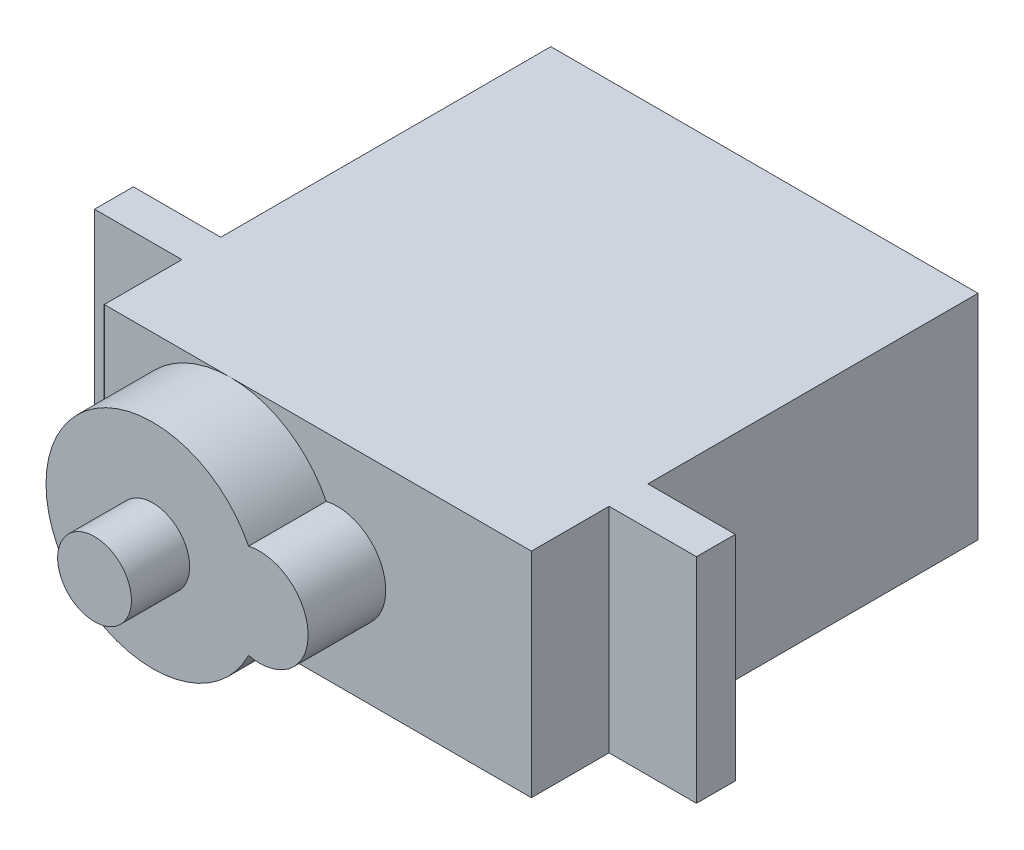
ISO-10303-21;
HEADER;
FILE_DESCRIPTION(('STEP AP214'),'2;1');
FILE_NAME('part.step','',(''),(''),'','','');
FILE_SCHEMA(('AUTOMOTIVE_DESIGN { 1 0 10303 214 1 1 1 1 }'));
ENDSEC;
DATA;
#1=APPLICATION_CONTEXT('core data for automotive mechanical design processes');
#2=APPLICATION_PROTOCOL_DEFINITION('international standard','automotive_design',2000,#1);
#3=PRODUCT_CONTEXT('',#1,'mechanical');
#4=PRODUCT('Part','Part','',(#3));
#5=PRODUCT_RELATED_PRODUCT_CATEGORY('part','',(#4));
#6=PRODUCT_DEFINITION_FORMATION('','',#4);
#7=PRODUCT_DEFINITION_CONTEXT('part definition',#1,'design');
#8=PRODUCT_DEFINITION('design','',#6,#7);
#9=PRODUCT_DEFINITION_SHAPE('','',#8);
#10=(LENGTH_UNIT() NAMED_UNIT(*) SI_UNIT(.MILLI.,.METRE.));
#11=(NAMED_UNIT(*) PLANE_ANGLE_UNIT() SI_UNIT($,.RADIAN.));
#12=(NAMED_UNIT(*) SI_UNIT($,.STERADIAN.) SOLID_ANGLE_UNIT());
#13=UNCERTAINTY_MEASURE_WITH_UNIT(LENGTH_MEASURE(1.E-05),#10,'distance_accuracy_value','');
#14=(GEOMETRIC_REPRESENTATION_CONTEXT(3) GLOBAL_UNCERTAINTY_ASSIGNED_CONTEXT((#13)) GLOBAL_UNIT_ASSIGNED_CONTEXT((#10,
#11,#12)) REPRESENTATION_CONTEXT('',''));
#15=CARTESIAN_POINT('',(0.,0.,0.));
#16=DIRECTION('',(0.,0.,1.));
#17=DIRECTION('',(1.,0.,0.));
#18=AXIS2_PLACEMENT_3D('',#15,#16,#17);
#19=CARTESIAN_POINT('',(0.,0.,23.));
#20=DIRECTION('',(0.,0.,1.));
#21=DIRECTION('',(1.,0.,0.));
#22=AXIS2_PLACEMENT_3D('',#19,#20,#21);
#23=PLANE('',#22);
#24=DIRECTION('',(1.,0.,0.));
#25=VECTOR('',#24,1.);
#26=CARTESIAN_POINT('',(-15.5,-5.50000000000001,23.));
#27=LINE('',#26,#25);
#28=CARTESIAN_POINT('',(-11.,-5.50000000000001,23.));
#29=VERTEX_POINT('',#28);
#30=CARTESIAN_POINT('',(-4.5,-5.5,23.));
#31=VERTEX_POINT('',#30);
#32=EDGE_CURVE('E243',#29,#31,#27,.T.);
#33=ORIENTED_EDGE('',*,*,#32,.T.);
#34=CARTESIAN_POINT('',(-4.5,0.,23.));
#35=DIRECTION('',(0.,0.,1.));
#36=DIRECTION('',(1.,0.,0.));
#37=AXIS2_PLACEMENT_3D('',#34,#35,#36);
#38=CIRCLE('',#37,5.5);
#39=CARTESIAN_POINT('',(-4.5,5.5,23.));
#40=VERTEX_POINT('',#39);
#41=EDGE_CURVE('E503',#40,#31,#38,.T.);
#42=ORIENTED_EDGE('',*,*,#41,.F.);
#43=DIRECTION('',(-1.,0.,0.));
#44=VECTOR('',#43,1.);
#45=CARTESIAN_POINT('',(-15.5,5.50000000000001,23.));
#46=LINE('',#45,#44);
#47=CARTESIAN_POINT('',(-11.,5.5,23.));
#48=VERTEX_POINT('',#47);
#49=EDGE_CURVE('E242',#40,#48,#46,.T.);
#50=ORIENTED_EDGE('',*,*,#49,.T.);
#51=DIRECTION('',(0.,-1.,0.));
#52=VECTOR('',#51,1.);
#53=CARTESIAN_POINT('',(-11.,0.,23.));
#54=LINE('',#53,#52);
#55=EDGE_CURVE('E204',#48,#29,#54,.T.);
#56=ORIENTED_EDGE('',*,*,#55,.T.);
#57=EDGE_LOOP('',(#33,#42,#50,#56));
#58=FACE_BOUND('',#57,.T.);
#59=ADVANCED_FACE('F35',(#58),#23,.T.);
#60=CARTESIAN_POINT('',(-15.5,5.50000000000001,23.));
#61=DIRECTION('',(0.,-1.,0.));
#62=DIRECTION('',(1.,0.,0.));
#63=AXIS2_PLACEMENT_3D('',#60,#61,#62);
#64=PLANE('',#63);
#65=DIRECTION('',(0.,0.,1.));
#66=VECTOR('',#65,1.);
#67=CARTESIAN_POINT('',(-11.,5.5,0.));
#68=LINE('',#67,#66);
#69=CARTESIAN_POINT('',(-11.,5.5,0.));
#70=VERTEX_POINT('',#69);
#71=CARTESIAN_POINT('',(-11.,5.5,17.));
#72=VERTEX_POINT('',#71);
#73=EDGE_CURVE('E59',#70,#72,#68,.T.);
#74=ORIENTED_EDGE('',*,*,#73,.T.);
#75=DIRECTION('',(-1.,0.,0.));
#76=VECTOR('',#75,1.);
#77=CARTESIAN_POINT('',(0.,5.5,17.));
#78=LINE('',#77,#76);
#79=CARTESIAN_POINT('',(-15.5,5.50000000000001,17.));
#80=VERTEX_POINT('',#79);
#81=EDGE_CURVE('E170',#72,#80,#78,.T.);
#82=ORIENTED_EDGE('',*,*,#81,.T.);
#83=DIRECTION('',(0.,0.,-1.));
#84=VECTOR('',#83,1.);
#85=CARTESIAN_POINT('',(-15.5,5.50000000000001,23.));
#86=LINE('',#85,#84);
#87=CARTESIAN_POINT('',(-15.5,5.50000000000001,19.));
#88=VERTEX_POINT('',#87);
#89=EDGE_CURVE('E44',#88,#80,#86,.T.);
#90=ORIENTED_EDGE('',*,*,#89,.F.);
#91=DIRECTION('',(-1.,0.,0.));
#92=VECTOR('',#91,1.);
#93=CARTESIAN_POINT('',(0.,5.5,19.));
#94=LINE('',#93,#92);
#95=CARTESIAN_POINT('',(-11.,5.5,19.));
#96=VERTEX_POINT('',#95);
#97=EDGE_CURVE('E203',#96,#88,#94,.T.);
#98=ORIENTED_EDGE('',*,*,#97,.F.);
#99=DIRECTION('',(0.,0.,1.));
#100=VECTOR('',#99,1.);
#101=CARTESIAN_POINT('',(-11.,5.5,19.));
#102=LINE('',#101,#100);
#103=EDGE_CURVE('E211',#96,#48,#102,.T.);
#104=ORIENTED_EDGE('',*,*,#103,.T.);
#105=ORIENTED_EDGE('',*,*,#49,.F.);
#106=CARTESIAN_POINT('',(11.,5.5,23.));
#107=VERTEX_POINT('',#106);
#108=EDGE_CURVE('E238',#107,#40,#46,.T.);
#109=ORIENTED_EDGE('',*,*,#108,.F.);
#110=DIRECTION('',(0.,0.,1.));
#111=VECTOR('',#110,1.);
#112=CARTESIAN_POINT('',(11.,5.5,19.));
#113=LINE('',#112,#111);
#114=CARTESIAN_POINT('',(11.,5.5,19.));
#115=VERTEX_POINT('',#114);
#116=EDGE_CURVE('E229',#115,#107,#113,.T.);
#117=ORIENTED_EDGE('',*,*,#116,.F.);
#118=DIRECTION('',(-1.,0.,0.));
#119=VECTOR('',#118,1.);
#120=CARTESIAN_POINT('',(0.,5.5,19.));
#121=LINE('',#120,#119);
#122=CARTESIAN_POINT('',(15.5,5.5,19.));
#123=VERTEX_POINT('',#122);
#124=EDGE_CURVE('E220',#123,#115,#121,.T.);
#125=ORIENTED_EDGE('',*,*,#124,.F.);
#126=DIRECTION('',(0.,0.,-1.));
#127=VECTOR('',#126,1.);
#128=CARTESIAN_POINT('',(15.5,5.5,23.));
#129=LINE('',#128,#127);
#130=CARTESIAN_POINT('',(15.5,5.5,17.));
#131=VERTEX_POINT('',#130);
#132=EDGE_CURVE('E11',#123,#131,#129,.T.);
#133=ORIENTED_EDGE('',*,*,#132,.T.);
#134=DIRECTION('',(-1.,0.,0.));
#135=VECTOR('',#134,1.);
#136=CARTESIAN_POINT('',(0.,5.5,17.));
#137=LINE('',#136,#135);
#138=CARTESIAN_POINT('',(11.,5.5,17.));
#139=VERTEX_POINT('',#138);
#140=EDGE_CURVE('E160',#131,#139,#137,.T.);
#141=ORIENTED_EDGE('',*,*,#140,.T.);
#142=DIRECTION('',(0.,0.,1.));
#143=VECTOR('',#142,1.);
#144=CARTESIAN_POINT('',(11.,5.5,0.));
#145=LINE('',#144,#143);
#146=CARTESIAN_POINT('',(11.,5.5,0.));
#147=VERTEX_POINT('',#146);
#148=EDGE_CURVE('E186',#147,#139,#145,.T.);
#149=ORIENTED_EDGE('',*,*,#148,.F.);
#150=DIRECTION('',(-1.,0.,0.));
#151=VECTOR('',#150,1.);
#152=CARTESIAN_POINT('',(-15.5,5.50000000000001,0.));
#153=LINE('',#152,#151);
#154=EDGE_CURVE('E237',#147,#70,#153,.T.);
#155=ORIENTED_EDGE('',*,*,#154,.T.);
#156=EDGE_LOOP('',(#74,#82,#90,#98,#104,#105,#109,#117,#125,#133,#141,#149,#155));
#157=FACE_BOUND('',#156,.T.);
#158=ADVANCED_FACE('F265',(#157),#64,.F.);
#159=CARTESIAN_POINT('',(-15.5,-5.50000000000001,23.));
#160=DIRECTION('',(0.,1.,0.));
#161=DIRECTION('',(0.,0.,1.));
#162=AXIS2_PLACEMENT_3D('',#159,#160,#161);
#163=PLANE('',#162);
#164=DIRECTION('',(0.,0.,1.));
#165=VECTOR('',#164,1.);
#166=CARTESIAN_POINT('',(-11.,-5.50000000000001,0.));
#167=LINE('',#166,#165);
#168=CARTESIAN_POINT('',(-11.,-5.50000000000001,0.));
#169=VERTEX_POINT('',#168);
#170=CARTESIAN_POINT('',(-11.,-5.50000000000001,17.));
#171=VERTEX_POINT('',#170);
#172=EDGE_CURVE('E179',#169,#171,#167,.T.);
#173=ORIENTED_EDGE('',*,*,#172,.F.);
#174=DIRECTION('',(1.,0.,0.));
#175=VECTOR('',#174,1.);
#176=CARTESIAN_POINT('',(-15.5,-5.50000000000001,0.));
#177=LINE('',#176,#175);
#178=CARTESIAN_POINT('',(11.,-5.50000000000001,0.));
#179=VERTEX_POINT('',#178);
#180=EDGE_CURVE('E249',#169,#179,#177,.T.);
#181=ORIENTED_EDGE('',*,*,#180,.T.);
#182=DIRECTION('',(0.,0.,1.));
#183=VECTOR('',#182,1.);
#184=CARTESIAN_POINT('',(11.,-5.50000000000001,0.));
#185=LINE('',#184,#183);
#186=CARTESIAN_POINT('',(11.,-5.50000000000001,17.));
#187=VERTEX_POINT('',#186);
#188=EDGE_CURVE('E171',#179,#187,#185,.T.);
#189=ORIENTED_EDGE('',*,*,#188,.T.);
#190=DIRECTION('',(1.,0.,0.));
#191=VECTOR('',#190,1.);
#192=CARTESIAN_POINT('',(0.,-5.50000000000001,17.));
#193=LINE('',#192,#191);
#194=CARTESIAN_POINT('',(15.5,-5.50000000000001,17.));
#195=VERTEX_POINT('',#194);
#196=EDGE_CURVE('E193',#187,#195,#193,.T.);
#197=ORIENTED_EDGE('',*,*,#196,.T.);
#198=DIRECTION('',(0.,0.,-1.));
#199=VECTOR('',#198,1.);
#200=CARTESIAN_POINT('',(15.5,-5.50000000000001,23.));
#201=LINE('',#200,#199);
#202=CARTESIAN_POINT('',(15.5,-5.50000000000001,19.));
#203=VERTEX_POINT('',#202);
#204=EDGE_CURVE('E246',#203,#195,#201,.T.);
#205=ORIENTED_EDGE('',*,*,#204,.F.);
#206=DIRECTION('',(1.,0.,0.));
#207=VECTOR('',#206,1.);
#208=CARTESIAN_POINT('',(0.,-5.50000000000001,19.));
#209=LINE('',#208,#207);
#210=CARTESIAN_POINT('',(11.,-5.50000000000001,19.));
#211=VERTEX_POINT('',#210);
#212=EDGE_CURVE('E225',#211,#203,#209,.T.);
#213=ORIENTED_EDGE('',*,*,#212,.F.);
#214=DIRECTION('',(0.,0.,1.));
#215=VECTOR('',#214,1.);
#216=CARTESIAN_POINT('',(11.,-5.50000000000001,19.));
#217=LINE('',#216,#215);
#218=CARTESIAN_POINT('',(11.,-5.50000000000001,23.));
#219=VERTEX_POINT('',#218);
#220=EDGE_CURVE('E214',#211,#219,#217,.T.);
#221=ORIENTED_EDGE('',*,*,#220,.T.);
#222=EDGE_CURVE('E241',#31,#219,#27,.T.);
#223=ORIENTED_EDGE('',*,*,#222,.F.);
#224=ORIENTED_EDGE('',*,*,#32,.F.);
#225=DIRECTION('',(0.,0.,1.));
#226=VECTOR('',#225,1.);
#227=CARTESIAN_POINT('',(-11.,-5.50000000000001,19.));
#228=LINE('',#227,#226);
#229=CARTESIAN_POINT('',(-11.,-5.50000000000001,19.));
#230=VERTEX_POINT('',#229);
#231=EDGE_CURVE('E215',#230,#29,#228,.T.);
#232=ORIENTED_EDGE('',*,*,#231,.F.);
#233=DIRECTION('',(1.,0.,0.));
#234=VECTOR('',#233,1.);
#235=CARTESIAN_POINT('',(0.,-5.50000000000001,19.));
#236=LINE('',#235,#234);
#237=CARTESIAN_POINT('',(-15.5,-5.50000000000001,19.));
#238=VERTEX_POINT('',#237);
#239=EDGE_CURVE('E208',#238,#230,#236,.T.);
#240=ORIENTED_EDGE('',*,*,#239,.F.);
#241=DIRECTION('',(0.,0.,-1.));
#242=VECTOR('',#241,1.);
#243=CARTESIAN_POINT('',(-15.5,-5.50000000000001,23.));
#244=LINE('',#243,#242);
#245=CARTESIAN_POINT('',(-15.5,-5.50000000000001,17.));
#246=VERTEX_POINT('',#245);
#247=EDGE_CURVE('E254',#238,#246,#244,.T.);
#248=ORIENTED_EDGE('',*,*,#247,.T.);
#249=DIRECTION('',(1.,0.,0.));
#250=VECTOR('',#249,1.);
#251=CARTESIAN_POINT('',(0.,-5.50000000000001,17.));
#252=LINE('',#251,#250);
#253=EDGE_CURVE('E166',#246,#171,#252,.T.);
#254=ORIENTED_EDGE('',*,*,#253,.T.);
#255=EDGE_LOOP('',(#173,#181,#189,#197,#205,#213,#221,#223,#224,#232,#240,#248,#254));
#256=FACE_BOUND('',#255,.T.);
#257=ADVANCED_FACE('F271',(#256),#163,.F.);
#258=CARTESIAN_POINT('',(0.,0.,0.));
#259=DIRECTION('',(0.,0.,1.));
#260=DIRECTION('',(1.,0.,0.));
#261=AXIS2_PLACEMENT_3D('',#258,#259,#260);
#262=PLANE('',#261);
#263=DIRECTION('',(0.,-1.,0.));
#264=VECTOR('',#263,1.);
#265=CARTESIAN_POINT('',(-11.,0.,0.));
#266=LINE('',#265,#264);
#267=EDGE_CURVE('E164',#70,#169,#266,.T.);
#268=ORIENTED_EDGE('',*,*,#267,.F.);
#269=ORIENTED_EDGE('',*,*,#154,.F.);
#270=DIRECTION('',(0.,-1.,0.));
#271=VECTOR('',#270,1.);
#272=CARTESIAN_POINT('',(11.,0.,0.));
#273=LINE('',#272,#271);
#274=EDGE_CURVE('E183',#147,#179,#273,.T.);
#275=ORIENTED_EDGE('',*,*,#274,.T.);
#276=ORIENTED_EDGE('',*,*,#180,.F.);
#277=EDGE_LOOP('',(#268,#269,#275,#276));
#278=FACE_BOUND('',#277,.T.);
#279=ADVANCED_FACE('F312',(#278),#262,.F.);
#280=CARTESIAN_POINT('',(1.,0.,23.));
#281=DIRECTION('',(0.,0.,1.));
#282=DIRECTION('',(1.,0.,0.));
#283=AXIS2_PLACEMENT_3D('',#280,#281,#282);
#284=CIRCLE('',#283,2.5);
#285=CARTESIAN_POINT('',(0.431818181818178,-2.43457787336688,23.));
#286=VERTEX_POINT('',#285);
#287=CARTESIAN_POINT('',(0.431818181818179,2.43457787336688,23.));
#288=VERTEX_POINT('',#287);
#289=EDGE_CURVE('E152',#286,#288,#284,.T.);
#290=ORIENTED_EDGE('',*,*,#289,.F.);
#291=EDGE_CURVE('E156',#31,#286,#38,.T.);
#292=ORIENTED_EDGE('',*,*,#291,.F.);
#293=ORIENTED_EDGE('',*,*,#222,.T.);
#294=DIRECTION('',(0.,-1.,0.));
#295=VECTOR('',#294,1.);
#296=CARTESIAN_POINT('',(11.,0.,23.));
#297=LINE('',#296,#295);
#298=EDGE_CURVE('E181',#107,#219,#297,.T.);
#299=ORIENTED_EDGE('',*,*,#298,.F.);
#300=ORIENTED_EDGE('',*,*,#108,.T.);
#301=EDGE_CURVE('E291',#288,#40,#38,.T.);
#302=ORIENTED_EDGE('',*,*,#301,.F.);
#303=EDGE_LOOP('',(#290,#292,#293,#299,#300,#302));
#304=FACE_BOUND('',#303,.T.);
#305=ADVANCED_FACE('F290',(#304),#23,.T.);
#306=CARTESIAN_POINT('',(15.5,5.5,23.));
#307=DIRECTION('',(-1.,0.,0.));
#308=DIRECTION('',(0.,-1.,0.));
#309=AXIS2_PLACEMENT_3D('',#306,#307,#308);
#310=PLANE('',#309);
#311=ORIENTED_EDGE('',*,*,#204,.T.);
#312=DIRECTION('',(0.,1.,0.));
#313=VECTOR('',#312,1.);
#314=CARTESIAN_POINT('',(15.5,0.,17.));
#315=LINE('',#314,#313);
#316=EDGE_CURVE('E187',#195,#131,#315,.T.);
#317=ORIENTED_EDGE('',*,*,#316,.T.);
#318=ORIENTED_EDGE('',*,*,#132,.F.);
#319=DIRECTION('',(0.,1.,0.));
#320=VECTOR('',#319,1.);
#321=CARTESIAN_POINT('',(15.5,0.,19.));
#322=LINE('',#321,#320);
#323=EDGE_CURVE('E227',#203,#123,#322,.T.);
#324=ORIENTED_EDGE('',*,*,#323,.F.);
#325=EDGE_LOOP('',(#311,#317,#318,#324));
#326=FACE_BOUND('',#325,.T.);
#327=ADVANCED_FACE('F37',(#326),#310,.F.);
#328=CARTESIAN_POINT('',(-15.5,5.50000000000001,23.));
#329=DIRECTION('',(1.,0.,0.));
#330=DIRECTION('',(0.,0.,-1.));
#331=AXIS2_PLACEMENT_3D('',#328,#329,#330);
#332=PLANE('',#331);
#333=ORIENTED_EDGE('',*,*,#89,.T.);
#334=DIRECTION('',(0.,-1.,0.));
#335=VECTOR('',#334,1.);
#336=CARTESIAN_POINT('',(-15.5,0.,17.));
#337=LINE('',#336,#335);
#338=EDGE_CURVE('E174',#80,#246,#337,.T.);
#339=ORIENTED_EDGE('',*,*,#338,.T.);
#340=ORIENTED_EDGE('',*,*,#247,.F.);
#341=DIRECTION('',(0.,-1.,0.));
#342=VECTOR('',#341,1.);
#343=CARTESIAN_POINT('',(-15.5,0.,19.));
#344=LINE('',#343,#342);
#345=EDGE_CURVE('E206',#88,#238,#344,.T.);
#346=ORIENTED_EDGE('',*,*,#345,.F.);
#347=EDGE_LOOP('',(#333,#339,#340,#346));
#348=FACE_BOUND('',#347,.T.);
#349=ADVANCED_FACE('F261',(#348),#332,.F.);
#350=CARTESIAN_POINT('',(11.,0.,19.));
#351=DIRECTION('',(-1.,0.,0.));
#352=DIRECTION('',(0.,0.,1.));
#353=AXIS2_PLACEMENT_3D('',#350,#351,#352);
#354=PLANE('',#353);
#355=ORIENTED_EDGE('',*,*,#298,.T.);
#356=ORIENTED_EDGE('',*,*,#220,.F.);
#357=DIRECTION('',(0.,-1.,0.));
#358=VECTOR('',#357,1.);
#359=CARTESIAN_POINT('',(11.,0.,19.));
#360=LINE('',#359,#358);
#361=EDGE_CURVE('E223',#115,#211,#360,.T.);
#362=ORIENTED_EDGE('',*,*,#361,.F.);
#363=ORIENTED_EDGE('',*,*,#116,.T.);
#364=EDGE_LOOP('',(#355,#356,#362,#363));
#365=FACE_BOUND('',#364,.T.);
#366=ADVANCED_FACE('F295',(#365),#354,.F.);
#367=CARTESIAN_POINT('',(0.,0.,19.));
#368=DIRECTION('',(0.,0.,1.));
#369=DIRECTION('',(1.,0.,0.));
#370=AXIS2_PLACEMENT_3D('',#367,#368,#369);
#371=PLANE('',#370);
#372=ORIENTED_EDGE('',*,*,#124,.T.);
#373=ORIENTED_EDGE('',*,*,#361,.T.);
#374=ORIENTED_EDGE('',*,*,#212,.T.);
#375=ORIENTED_EDGE('',*,*,#323,.T.);
#376=EDGE_LOOP('',(#372,#373,#374,#375));
#377=FACE_BOUND('',#376,.T.);
#378=ADVANCED_FACE('F300',(#377),#371,.T.);
#379=CARTESIAN_POINT('',(-11.,0.,19.));
#380=DIRECTION('',(-1.,0.,0.));
#381=DIRECTION('',(0.,0.,1.));
#382=AXIS2_PLACEMENT_3D('',#379,#380,#381);
#383=PLANE('',#382);
#384=ORIENTED_EDGE('',*,*,#55,.F.);
#385=ORIENTED_EDGE('',*,*,#103,.F.);
#386=DIRECTION('',(0.,-1.,0.));
#387=VECTOR('',#386,1.);
#388=CARTESIAN_POINT('',(-11.,0.,19.));
#389=LINE('',#388,#387);
#390=EDGE_CURVE('E201',#96,#230,#389,.T.);
#391=ORIENTED_EDGE('',*,*,#390,.T.);
#392=ORIENTED_EDGE('',*,*,#231,.T.);
#393=EDGE_LOOP('',(#384,#385,#391,#392));
#394=FACE_BOUND('',#393,.T.);
#395=ADVANCED_FACE('F281',(#394),#383,.T.);
#396=CARTESIAN_POINT('',(0.,0.,19.));
#397=DIRECTION('',(0.,0.,1.));
#398=DIRECTION('',(1.,0.,0.));
#399=AXIS2_PLACEMENT_3D('',#396,#397,#398);
#400=PLANE('',#399);
#401=ORIENTED_EDGE('',*,*,#390,.F.);
#402=ORIENTED_EDGE('',*,*,#97,.T.);
#403=ORIENTED_EDGE('',*,*,#345,.T.);
#404=ORIENTED_EDGE('',*,*,#239,.T.);
#405=EDGE_LOOP('',(#401,#402,#403,#404));
#406=FACE_BOUND('',#405,.T.);
#407=ADVANCED_FACE('F278',(#406),#400,.T.);
#408=CARTESIAN_POINT('',(11.,0.,0.));
#409=DIRECTION('',(-1.,0.,0.));
#410=DIRECTION('',(0.,0.,1.));
#411=AXIS2_PLACEMENT_3D('',#408,#409,#410);
#412=PLANE('',#411);
#413=DIRECTION('',(0.,-1.,0.));
#414=VECTOR('',#413,1.);
#415=CARTESIAN_POINT('',(11.,0.,17.));
#416=LINE('',#415,#414);
#417=EDGE_CURVE('E190',#139,#187,#416,.T.);
#418=ORIENTED_EDGE('',*,*,#417,.T.);
#419=ORIENTED_EDGE('',*,*,#188,.F.);
#420=ORIENTED_EDGE('',*,*,#274,.F.);
#421=ORIENTED_EDGE('',*,*,#148,.T.);
#422=EDGE_LOOP('',(#418,#419,#420,#421));
#423=FACE_BOUND('',#422,.T.);
#424=ADVANCED_FACE('F310',(#423),#412,.F.);
#425=CARTESIAN_POINT('',(0.,0.,17.));
#426=DIRECTION('',(0.,0.,1.));
#427=DIRECTION('',(1.,0.,0.));
#428=AXIS2_PLACEMENT_3D('',#425,#426,#427);
#429=PLANE('',#428);
#430=ORIENTED_EDGE('',*,*,#140,.F.);
#431=ORIENTED_EDGE('',*,*,#316,.F.);
#432=ORIENTED_EDGE('',*,*,#196,.F.);
#433=ORIENTED_EDGE('',*,*,#417,.F.);
#434=EDGE_LOOP('',(#430,#431,#432,#433));
#435=FACE_BOUND('',#434,.T.);
#436=ADVANCED_FACE('F308',(#435),#429,.F.);
#437=CARTESIAN_POINT('',(-11.,0.,0.));
#438=DIRECTION('',(-1.,0.,0.));
#439=DIRECTION('',(0.,0.,1.));
#440=AXIS2_PLACEMENT_3D('',#437,#438,#439);
#441=PLANE('',#440);
#442=DIRECTION('',(0.,-1.,0.));
#443=VECTOR('',#442,1.);
#444=CARTESIAN_POINT('',(-11.,0.,17.));
#445=LINE('',#444,#443);
#446=EDGE_CURVE('E167',#72,#171,#445,.T.);
#447=ORIENTED_EDGE('',*,*,#446,.F.);
#448=ORIENTED_EDGE('',*,*,#73,.F.);
#449=ORIENTED_EDGE('',*,*,#267,.T.);
#450=ORIENTED_EDGE('',*,*,#172,.T.);
#451=EDGE_LOOP('',(#447,#448,#449,#450));
#452=FACE_BOUND('',#451,.T.);
#453=ADVANCED_FACE('F313',(#452),#441,.T.);
#454=CARTESIAN_POINT('',(0.,0.,17.));
#455=DIRECTION('',(0.,0.,1.));
#456=DIRECTION('',(1.,0.,0.));
#457=AXIS2_PLACEMENT_3D('',#454,#455,#456);
#458=PLANE('',#457);
#459=ORIENTED_EDGE('',*,*,#446,.T.);
#460=ORIENTED_EDGE('',*,*,#253,.F.);
#461=ORIENTED_EDGE('',*,*,#338,.F.);
#462=ORIENTED_EDGE('',*,*,#81,.F.);
#463=EDGE_LOOP('',(#459,#460,#461,#462));
#464=FACE_BOUND('',#463,.T.);
#465=ADVANCED_FACE('F268',(#464),#458,.F.);
#466=CARTESIAN_POINT('',(-4.5,0.,27.));
#467=DIRECTION('',(0.,0.,-1.));
#468=DIRECTION('',(-1.,0.,0.));
#469=AXIS2_PLACEMENT_3D('',#466,#467,#468);
#470=CYLINDRICAL_SURFACE('',#469,5.5);
#471=ORIENTED_EDGE('',*,*,#301,.T.);
#472=ORIENTED_EDGE('',*,*,#41,.T.);
#473=ORIENTED_EDGE('',*,*,#291,.T.);
#474=DIRECTION('',(0.,0.,-1.));
#475=VECTOR('',#474,1.);
#476=CARTESIAN_POINT('',(0.431818181818179,-2.43457787336688,27.));
#477=LINE('',#476,#475);
#478=CARTESIAN_POINT('',(0.431818181818179,-2.43457787336688,27.));
#479=VERTEX_POINT('',#478);
#480=EDGE_CURVE('E51',#479,#286,#477,.T.);
#481=ORIENTED_EDGE('',*,*,#480,.F.);
#482=CARTESIAN_POINT('',(-4.5,0.,27.));
#483=DIRECTION('',(0.,0.,1.));
#484=DIRECTION('',(1.,0.,0.));
#485=AXIS2_PLACEMENT_3D('',#482,#483,#484);
#486=CIRCLE('',#485,5.5);
#487=CARTESIAN_POINT('',(0.431818181818179,2.43457787336688,27.));
#488=VERTEX_POINT('',#487);
#489=EDGE_CURVE('E148',#488,#479,#486,.T.);
#490=ORIENTED_EDGE('',*,*,#489,.F.);
#491=DIRECTION('',(0.,0.,-1.));
#492=VECTOR('',#491,1.);
#493=CARTESIAN_POINT('',(0.431818181818179,2.43457787336688,27.));
#494=LINE('',#493,#492);
#495=EDGE_CURVE('E145',#488,#288,#494,.T.);
#496=ORIENTED_EDGE('',*,*,#495,.T.);
#497=EDGE_LOOP('',(#471,#472,#473,#481,#490,#496));
#498=FACE_BOUND('',#497,.T.);
#499=ADVANCED_FACE('F154',(#498),#470,.T.);
#500=CARTESIAN_POINT('',(1.,0.,27.));
#501=DIRECTION('',(0.,0.,-1.));
#502=DIRECTION('',(-1.,0.,0.));
#503=AXIS2_PLACEMENT_3D('',#500,#501,#502);
#504=CYLINDRICAL_SURFACE('',#503,2.5);
#505=ORIENTED_EDGE('',*,*,#289,.T.);
#506=ORIENTED_EDGE('',*,*,#495,.F.);
#507=CARTESIAN_POINT('',(1.,0.,27.));
#508=DIRECTION('',(0.,0.,1.));
#509=DIRECTION('',(1.,0.,0.));
#510=AXIS2_PLACEMENT_3D('',#507,#508,#509);
#511=CIRCLE('',#510,2.5);
#512=EDGE_CURVE('E141',#479,#488,#511,.T.);
#513=ORIENTED_EDGE('',*,*,#512,.F.);
#514=ORIENTED_EDGE('',*,*,#480,.T.);
#515=EDGE_LOOP('',(#505,#506,#513,#514));
#516=FACE_BOUND('',#515,.T.);
#517=ADVANCED_FACE('F143',(#516),#504,.T.);
#518=CARTESIAN_POINT('',(0.,0.,27.));
#519=DIRECTION('',(0.,0.,1.));
#520=DIRECTION('',(1.,0.,0.));
#521=AXIS2_PLACEMENT_3D('',#518,#519,#520);
#522=PLANE('',#521);
#523=CARTESIAN_POINT('',(-4.5,0.,27.));
#524=DIRECTION('',(0.,0.,1.));
#525=DIRECTION('',(1.,0.,0.));
#526=AXIS2_PLACEMENT_3D('',#523,#524,#525);
#527=CIRCLE('',#526,1.9);
#528=CARTESIAN_POINT('',(-2.6,0.,27.));
#529=VERTEX_POINT('',#528);
#530=EDGE_CURVE('E39',#529,#529,#527,.T.);
#531=ORIENTED_EDGE('',*,*,#530,.F.);
#532=EDGE_LOOP('',(#531));
#533=FACE_BOUND('',#532,.T.);
#534=ORIENTED_EDGE('',*,*,#489,.T.);
#535=ORIENTED_EDGE('',*,*,#512,.T.);
#536=EDGE_LOOP('',(#534,#535));
#537=FACE_BOUND('',#536,.T.);
#538=ADVANCED_FACE('F150',(#533,#537),#522,.T.);
#539=CARTESIAN_POINT('',(0.,0.,30.));
#540=DIRECTION('',(0.,0.,1.));
#541=DIRECTION('',(1.,0.,0.));
#542=AXIS2_PLACEMENT_3D('',#539,#540,#541);
#543=PLANE('',#542);
#544=CARTESIAN_POINT('',(-4.5,0.,30.));
#545=DIRECTION('',(0.,0.,1.));
#546=DIRECTION('',(1.,0.,0.));
#547=AXIS2_PLACEMENT_3D('',#544,#545,#546);
#548=CIRCLE('',#547,1.9);
#549=CARTESIAN_POINT('',(-2.6,0.,30.));
#550=VERTEX_POINT('',#549);
#551=EDGE_CURVE('E217',#550,#550,#548,.T.);
#552=ORIENTED_EDGE('',*,*,#551,.T.);
#553=EDGE_LOOP('',(#552));
#554=FACE_BOUND('',#553,.T.);
#555=ADVANCED_FACE('F350',(#554),#543,.T.);
#556=CARTESIAN_POINT('',(-4.5,0.,30.));
#557=DIRECTION('',(0.,0.,-1.));
#558=DIRECTION('',(-1.,0.,0.));
#559=AXIS2_PLACEMENT_3D('',#556,#557,#558);
#560=CYLINDRICAL_SURFACE('',#559,1.9);
#561=ORIENTED_EDGE('',*,*,#530,.T.);
#562=EDGE_LOOP('',(#561));
#563=FACE_BOUND('',#562,.T.);
#564=ORIENTED_EDGE('',*,*,#551,.F.);
#565=EDGE_LOOP('',(#564));
#566=FACE_BOUND('',#565,.T.);
#567=ADVANCED_FACE('F352',(#563,#566),#560,.T.);
#568=CLOSED_SHELL('',(#59,#158,#257,#279,#305,#327,#349,#366,#378,#395,#407,#424,#436,#453,#465,
#499,#517,#538,#555,#567));
#569=MANIFOLD_SOLID_BREP('B2',#568);
#570=ADVANCED_BREP_SHAPE_REPRESENTATION('',(#18,#569),#14);
#571=SHAPE_DEFINITION_REPRESENTATION(#9,#570);
ENDSEC;
END-ISO-10303-21;
